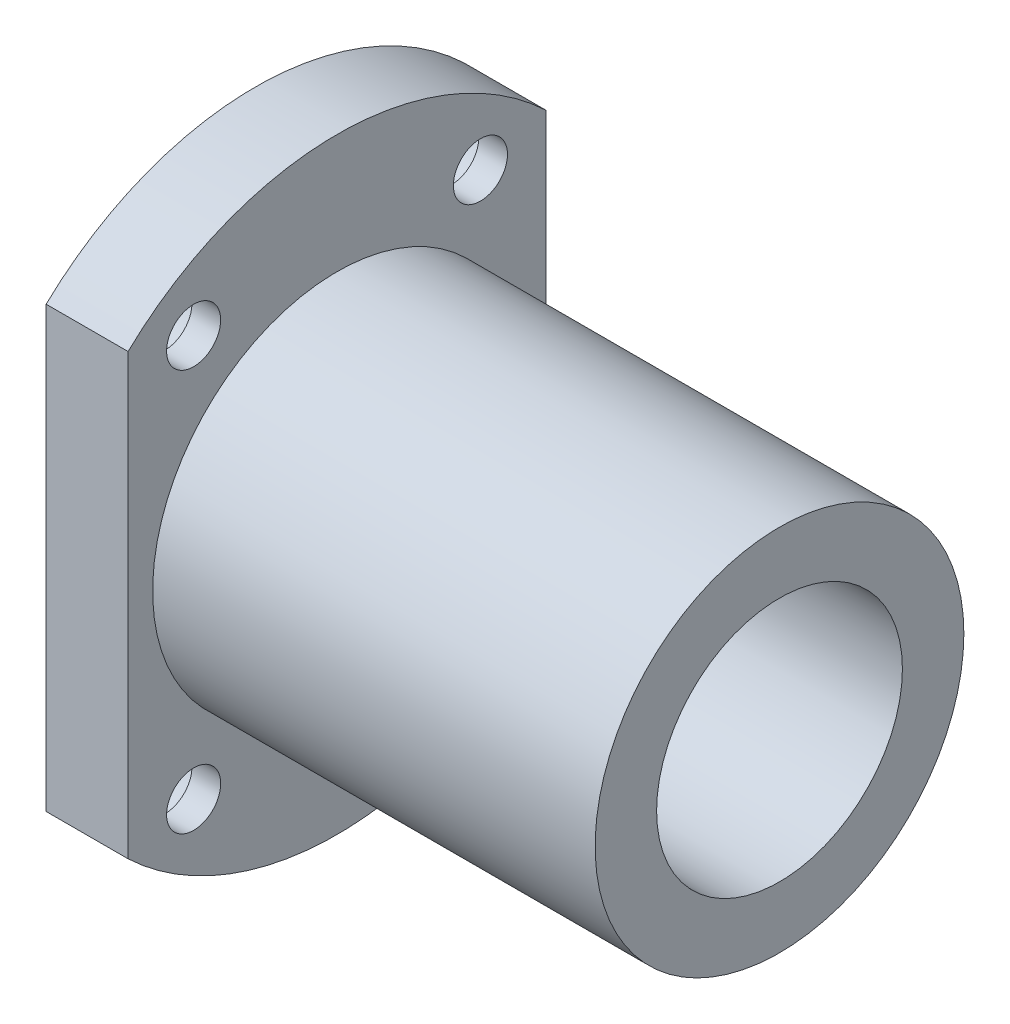
ISO-10303-21;
HEADER;
FILE_DESCRIPTION(('STEP AP214'),'2;1');
FILE_NAME('part.step','',(''),(''),'','','');
FILE_SCHEMA(('AUTOMOTIVE_DESIGN { 1 0 10303 214 1 1 1 1 }'));
ENDSEC;
DATA;
#1=APPLICATION_CONTEXT('core data for automotive mechanical design processes');
#2=APPLICATION_PROTOCOL_DEFINITION('international standard','automotive_design',2000,#1);
#3=PRODUCT_CONTEXT('',#1,'mechanical');
#4=PRODUCT('Part','Part','',(#3));
#5=PRODUCT_RELATED_PRODUCT_CATEGORY('part','',(#4));
#6=PRODUCT_DEFINITION_FORMATION('','',#4);
#7=PRODUCT_DEFINITION_CONTEXT('part definition',#1,'design');
#8=PRODUCT_DEFINITION('design','',#6,#7);
#9=PRODUCT_DEFINITION_SHAPE('','',#8);
#10=(LENGTH_UNIT() NAMED_UNIT(*) SI_UNIT(.MILLI.,.METRE.));
#11=(NAMED_UNIT(*) PLANE_ANGLE_UNIT() SI_UNIT($,.RADIAN.));
#12=(NAMED_UNIT(*) SI_UNIT($,.STERADIAN.) SOLID_ANGLE_UNIT());
#13=UNCERTAINTY_MEASURE_WITH_UNIT(LENGTH_MEASURE(1.E-05),#10,'distance_accuracy_value','');
#14=(GEOMETRIC_REPRESENTATION_CONTEXT(3) GLOBAL_UNCERTAINTY_ASSIGNED_CONTEXT((#13)) GLOBAL_UNIT_ASSIGNED_CONTEXT((#10,
#11,#12)) REPRESENTATION_CONTEXT('',''));
#15=CARTESIAN_POINT('',(0.,0.,0.));
#16=DIRECTION('',(0.,0.,1.));
#17=DIRECTION('',(1.,0.,0.));
#18=AXIS2_PLACEMENT_3D('',#15,#16,#17);
#19=CARTESIAN_POINT('',(10.,0.,0.));
#20=DIRECTION('',(-1.,0.,0.));
#21=DIRECTION('',(0.,0.,1.));
#22=AXIS2_PLACEMENT_3D('',#19,#20,#21);
#23=CYLINDRICAL_SURFACE('',#22,37.);
#24=CARTESIAN_POINT('',(10.,0.,0.));
#25=DIRECTION('',(1.,0.,0.));
#26=DIRECTION('',(0.,0.,-1.));
#27=AXIS2_PLACEMENT_3D('',#24,#25,#26);
#28=CIRCLE('',#27,37.);
#29=CARTESIAN_POINT('',(10.,-26.809513236909,25.5));
#30=VERTEX_POINT('',#29);
#31=CARTESIAN_POINT('',(10.,-26.809513236909,-25.5));
#32=VERTEX_POINT('',#31);
#33=EDGE_CURVE('E46',#30,#32,#28,.T.);
#34=ORIENTED_EDGE('',*,*,#33,.F.);
#35=DIRECTION('',(-1.,0.,0.));
#36=VECTOR('',#35,1.);
#37=CARTESIAN_POINT('',(64.,-26.809513236909,25.5));
#38=LINE('',#37,#36);
#39=CARTESIAN_POINT('',(0.,-26.809513236909,25.5));
#40=VERTEX_POINT('',#39);
#41=EDGE_CURVE('E81',#30,#40,#38,.T.);
#42=ORIENTED_EDGE('',*,*,#41,.T.);
#43=CARTESIAN_POINT('',(0.,0.,0.));
#44=DIRECTION('',(1.,0.,0.));
#45=DIRECTION('',(0.,0.,-1.));
#46=AXIS2_PLACEMENT_3D('',#43,#44,#45);
#47=CIRCLE('',#46,37.);
#48=CARTESIAN_POINT('',(0.,-26.809513236909,-25.5));
#49=VERTEX_POINT('',#48);
#50=EDGE_CURVE('E62',#40,#49,#47,.T.);
#51=ORIENTED_EDGE('',*,*,#50,.T.);
#52=DIRECTION('',(-1.,0.,0.));
#53=VECTOR('',#52,1.);
#54=CARTESIAN_POINT('',(64.,-26.809513236909,-25.5));
#55=LINE('',#54,#53);
#56=EDGE_CURVE('E142',#32,#49,#55,.T.);
#57=ORIENTED_EDGE('',*,*,#56,.F.);
#58=EDGE_LOOP('',(#34,#42,#51,#57));
#59=FACE_BOUND('',#58,.T.);
#60=ADVANCED_FACE('F37',(#59),#23,.T.);
#61=CARTESIAN_POINT('',(0.,26.809513236909,-25.5));
#62=VERTEX_POINT('',#61);
#63=CARTESIAN_POINT('',(0.,26.809513236909,25.5));
#64=VERTEX_POINT('',#63);
#65=EDGE_CURVE('E94',#62,#64,#47,.T.);
#66=ORIENTED_EDGE('',*,*,#65,.T.);
#67=DIRECTION('',(-1.,0.,0.));
#68=VECTOR('',#67,1.);
#69=CARTESIAN_POINT('',(64.,26.809513236909,25.5));
#70=LINE('',#69,#68);
#71=CARTESIAN_POINT('',(10.,26.809513236909,25.5));
#72=VERTEX_POINT('',#71);
#73=EDGE_CURVE('E54',#72,#64,#70,.T.);
#74=ORIENTED_EDGE('',*,*,#73,.F.);
#75=CARTESIAN_POINT('',(10.,26.809513236909,-25.5));
#76=VERTEX_POINT('',#75);
#77=EDGE_CURVE('E11',#76,#72,#28,.T.);
#78=ORIENTED_EDGE('',*,*,#77,.F.);
#79=DIRECTION('',(-1.,0.,0.));
#80=VECTOR('',#79,1.);
#81=CARTESIAN_POINT('',(64.,26.809513236909,-25.5));
#82=LINE('',#81,#80);
#83=EDGE_CURVE('E143',#76,#62,#82,.T.);
#84=ORIENTED_EDGE('',*,*,#83,.T.);
#85=EDGE_LOOP('',(#66,#74,#78,#84));
#86=FACE_BOUND('',#85,.T.);
#87=ADVANCED_FACE('F39',(#86),#23,.T.);
#88=CARTESIAN_POINT('',(10.,0.,0.));
#89=DIRECTION('',(1.,0.,0.));
#90=DIRECTION('',(0.,0.,-1.));
#91=AXIS2_PLACEMENT_3D('',#88,#89,#90);
#92=PLANE('',#91);
#93=CARTESIAN_POINT('',(10.,24.5,-17.5));
#94=DIRECTION('',(1.,0.,0.));
#95=DIRECTION('',(0.,0.,-1.));
#96=AXIS2_PLACEMENT_3D('',#93,#94,#95);
#97=CIRCLE('',#96,3.3);
#98=CARTESIAN_POINT('',(10.,24.5,-20.8));
#99=VERTEX_POINT('',#98);
#100=EDGE_CURVE('E41',#99,#99,#97,.T.);
#101=ORIENTED_EDGE('',*,*,#100,.F.);
#102=EDGE_LOOP('',(#101));
#103=FACE_BOUND('',#102,.T.);
#104=CARTESIAN_POINT('',(10.,24.5,17.5));
#105=DIRECTION('',(1.,0.,0.));
#106=DIRECTION('',(0.,0.,-1.));
#107=AXIS2_PLACEMENT_3D('',#104,#105,#106);
#108=CIRCLE('',#107,3.3);
#109=CARTESIAN_POINT('',(10.,24.5,14.2));
#110=VERTEX_POINT('',#109);
#111=EDGE_CURVE('E109',#110,#110,#108,.T.);
#112=ORIENTED_EDGE('',*,*,#111,.F.);
#113=EDGE_LOOP('',(#112));
#114=FACE_BOUND('',#113,.T.);
#115=CARTESIAN_POINT('',(10.,-24.5,17.5));
#116=DIRECTION('',(1.,0.,0.));
#117=DIRECTION('',(0.,0.,-1.));
#118=AXIS2_PLACEMENT_3D('',#115,#116,#117);
#119=CIRCLE('',#118,3.3);
#120=CARTESIAN_POINT('',(10.,-24.5,14.2));
#121=VERTEX_POINT('',#120);
#122=EDGE_CURVE('E105',#121,#121,#119,.T.);
#123=ORIENTED_EDGE('',*,*,#122,.F.);
#124=EDGE_LOOP('',(#123));
#125=FACE_BOUND('',#124,.T.);
#126=CARTESIAN_POINT('',(10.,-24.5,-17.5));
#127=DIRECTION('',(1.,0.,0.));
#128=DIRECTION('',(0.,0.,-1.));
#129=AXIS2_PLACEMENT_3D('',#126,#127,#128);
#130=CIRCLE('',#129,3.3);
#131=CARTESIAN_POINT('',(10.,-24.5,-20.8));
#132=VERTEX_POINT('',#131);
#133=EDGE_CURVE('E86',#132,#132,#130,.T.);
#134=ORIENTED_EDGE('',*,*,#133,.F.);
#135=EDGE_LOOP('',(#134));
#136=FACE_BOUND('',#135,.T.);
#137=DIRECTION('',(0.,1.,0.));
#138=VECTOR('',#137,1.);
#139=CARTESIAN_POINT('',(10.,0.,25.5));
#140=LINE('',#139,#138);
#141=EDGE_CURVE('E89',#30,#72,#140,.T.);
#142=ORIENTED_EDGE('',*,*,#141,.F.);
#143=ORIENTED_EDGE('',*,*,#33,.T.);
#144=DIRECTION('',(0.,-1.,0.));
#145=VECTOR('',#144,1.);
#146=CARTESIAN_POINT('',(10.,0.,-25.5));
#147=LINE('',#146,#145);
#148=EDGE_CURVE('E146',#76,#32,#147,.T.);
#149=ORIENTED_EDGE('',*,*,#148,.F.);
#150=ORIENTED_EDGE('',*,*,#77,.T.);
#151=EDGE_LOOP('',(#142,#143,#149,#150));
#152=FACE_BOUND('',#151,.T.);
#153=CARTESIAN_POINT('',(10.,0.,0.));
#154=DIRECTION('',(1.,0.,0.));
#155=DIRECTION('',(0.,0.,-1.));
#156=AXIS2_PLACEMENT_3D('',#153,#154,#155);
#157=CIRCLE('',#156,22.5);
#158=CARTESIAN_POINT('',(10.,0.,-22.5));
#159=VERTEX_POINT('',#158);
#160=EDGE_CURVE('E98',#159,#159,#157,.T.);
#161=ORIENTED_EDGE('',*,*,#160,.F.);
#162=EDGE_LOOP('',(#161));
#163=FACE_BOUND('',#162,.T.);
#164=ADVANCED_FACE('F160',(#103,#114,#125,#136,#152,#163),#92,.T.);
#165=CARTESIAN_POINT('',(0.,0.,0.));
#166=DIRECTION('',(1.,0.,0.));
#167=DIRECTION('',(0.,0.,-1.));
#168=AXIS2_PLACEMENT_3D('',#165,#166,#167);
#169=PLANE('',#168);
#170=CARTESIAN_POINT('',(0.,24.5,-17.5));
#171=DIRECTION('',(-1.,0.,0.));
#172=DIRECTION('',(0.,0.,1.));
#173=AXIS2_PLACEMENT_3D('',#170,#171,#172);
#174=CIRCLE('',#173,5.49999999999999);
#175=CARTESIAN_POINT('',(0.,24.5,-12.));
#176=VERTEX_POINT('',#175);
#177=EDGE_CURVE('E373',#176,#176,#174,.T.);
#178=ORIENTED_EDGE('',*,*,#177,.F.);
#179=EDGE_LOOP('',(#178));
#180=FACE_BOUND('',#179,.T.);
#181=CARTESIAN_POINT('',(0.,24.5,17.5));
#182=DIRECTION('',(-1.,0.,0.));
#183=DIRECTION('',(0.,0.,1.));
#184=AXIS2_PLACEMENT_3D('',#181,#182,#183);
#185=CIRCLE('',#184,5.49999999999999);
#186=CARTESIAN_POINT('',(0.,24.5,23.));
#187=VERTEX_POINT('',#186);
#188=EDGE_CURVE('E124',#187,#187,#185,.T.);
#189=ORIENTED_EDGE('',*,*,#188,.F.);
#190=EDGE_LOOP('',(#189));
#191=FACE_BOUND('',#190,.T.);
#192=CARTESIAN_POINT('',(0.,-24.5,17.5));
#193=DIRECTION('',(-1.,0.,0.));
#194=DIRECTION('',(0.,0.,1.));
#195=AXIS2_PLACEMENT_3D('',#192,#193,#194);
#196=CIRCLE('',#195,5.49999999999999);
#197=CARTESIAN_POINT('',(0.,-24.5,23.));
#198=VERTEX_POINT('',#197);
#199=EDGE_CURVE('E111',#198,#198,#196,.T.);
#200=ORIENTED_EDGE('',*,*,#199,.F.);
#201=EDGE_LOOP('',(#200));
#202=FACE_BOUND('',#201,.T.);
#203=CARTESIAN_POINT('',(0.,-24.5,-17.5));
#204=DIRECTION('',(-1.,0.,0.));
#205=DIRECTION('',(0.,0.,1.));
#206=AXIS2_PLACEMENT_3D('',#203,#204,#205);
#207=CIRCLE('',#206,5.49999999999999);
#208=CARTESIAN_POINT('',(0.,-24.5,-12.));
#209=VERTEX_POINT('',#208);
#210=EDGE_CURVE('E107',#209,#209,#207,.T.);
#211=ORIENTED_EDGE('',*,*,#210,.F.);
#212=EDGE_LOOP('',(#211));
#213=FACE_BOUND('',#212,.T.);
#214=CARTESIAN_POINT('',(0.,0.,0.));
#215=DIRECTION('',(-1.,0.,0.));
#216=DIRECTION('',(0.,0.,1.));
#217=AXIS2_PLACEMENT_3D('',#214,#215,#216);
#218=CIRCLE('',#217,15.);
#219=CARTESIAN_POINT('',(0.,0.,15.));
#220=VERTEX_POINT('',#219);
#221=EDGE_CURVE('E150',#220,#220,#218,.T.);
#222=ORIENTED_EDGE('',*,*,#221,.F.);
#223=EDGE_LOOP('',(#222));
#224=FACE_BOUND('',#223,.T.);
#225=ORIENTED_EDGE('',*,*,#50,.F.);
#226=DIRECTION('',(0.,-1.,0.));
#227=VECTOR('',#226,1.);
#228=CARTESIAN_POINT('',(0.,26.809513236909,25.5));
#229=LINE('',#228,#227);
#230=EDGE_CURVE('E79',#64,#40,#229,.T.);
#231=ORIENTED_EDGE('',*,*,#230,.F.);
#232=ORIENTED_EDGE('',*,*,#65,.F.);
#233=DIRECTION('',(0.,1.,0.));
#234=VECTOR('',#233,1.);
#235=CARTESIAN_POINT('',(0.,26.809513236909,-25.5));
#236=LINE('',#235,#234);
#237=EDGE_CURVE('E93',#49,#62,#236,.T.);
#238=ORIENTED_EDGE('',*,*,#237,.F.);
#239=EDGE_LOOP('',(#225,#231,#232,#238));
#240=FACE_BOUND('',#239,.T.);
#241=ADVANCED_FACE('F92',(#180,#191,#202,#213,#224,#240),#169,.F.);
#242=CARTESIAN_POINT('',(64.,0.,0.));
#243=DIRECTION('',(-1.,0.,0.));
#244=DIRECTION('',(0.,0.,1.));
#245=AXIS2_PLACEMENT_3D('',#242,#243,#244);
#246=CYLINDRICAL_SURFACE('',#245,22.5);
#247=CARTESIAN_POINT('',(64.,0.,0.));
#248=DIRECTION('',(1.,0.,0.));
#249=DIRECTION('',(0.,0.,-1.));
#250=AXIS2_PLACEMENT_3D('',#247,#248,#249);
#251=CIRCLE('',#250,22.5);
#252=CARTESIAN_POINT('',(64.,0.,-22.5));
#253=VERTEX_POINT('',#252);
#254=EDGE_CURVE('E95',#253,#253,#251,.T.);
#255=ORIENTED_EDGE('',*,*,#254,.F.);
#256=EDGE_LOOP('',(#255));
#257=FACE_BOUND('',#256,.T.);
#258=ORIENTED_EDGE('',*,*,#160,.T.);
#259=EDGE_LOOP('',(#258));
#260=FACE_BOUND('',#259,.T.);
#261=ADVANCED_FACE('F158',(#257,#260),#246,.T.);
#262=CARTESIAN_POINT('',(64.,0.,0.));
#263=DIRECTION('',(1.,0.,0.));
#264=DIRECTION('',(0.,0.,-1.));
#265=AXIS2_PLACEMENT_3D('',#262,#263,#264);
#266=PLANE('',#265);
#267=CARTESIAN_POINT('',(64.,0.,0.));
#268=DIRECTION('',(-1.,0.,0.));
#269=DIRECTION('',(0.,0.,1.));
#270=AXIS2_PLACEMENT_3D('',#267,#268,#269);
#271=CIRCLE('',#270,15.);
#272=CARTESIAN_POINT('',(64.,0.,15.));
#273=VERTEX_POINT('',#272);
#274=EDGE_CURVE('E151',#273,#273,#271,.T.);
#275=ORIENTED_EDGE('',*,*,#274,.T.);
#276=EDGE_LOOP('',(#275));
#277=FACE_BOUND('',#276,.T.);
#278=ORIENTED_EDGE('',*,*,#254,.T.);
#279=EDGE_LOOP('',(#278));
#280=FACE_BOUND('',#279,.T.);
#281=ADVANCED_FACE('F340',(#277,#280),#266,.T.);
#282=CARTESIAN_POINT('',(64.,0.,0.));
#283=DIRECTION('',(-1.,0.,0.));
#284=DIRECTION('',(0.,0.,1.));
#285=AXIS2_PLACEMENT_3D('',#282,#283,#284);
#286=CYLINDRICAL_SURFACE('',#285,15.);
#287=ORIENTED_EDGE('',*,*,#274,.F.);
#288=EDGE_LOOP('',(#287));
#289=FACE_BOUND('',#288,.T.);
#290=ORIENTED_EDGE('',*,*,#221,.T.);
#291=EDGE_LOOP('',(#290));
#292=FACE_BOUND('',#291,.T.);
#293=ADVANCED_FACE('F192',(#289,#292),#286,.F.);
#294=CARTESIAN_POINT('',(64.,26.809513236909,-25.5));
#295=DIRECTION('',(0.,0.,1.));
#296=DIRECTION('',(0.,-1.,0.));
#297=AXIS2_PLACEMENT_3D('',#294,#295,#296);
#298=PLANE('',#297);
#299=ORIENTED_EDGE('',*,*,#148,.T.);
#300=ORIENTED_EDGE('',*,*,#56,.T.);
#301=ORIENTED_EDGE('',*,*,#237,.T.);
#302=ORIENTED_EDGE('',*,*,#83,.F.);
#303=EDGE_LOOP('',(#299,#300,#301,#302));
#304=FACE_BOUND('',#303,.T.);
#305=ADVANCED_FACE('F187',(#304),#298,.F.);
#306=CARTESIAN_POINT('',(64.,26.809513236909,25.5));
#307=DIRECTION('',(0.,0.,-1.));
#308=DIRECTION('',(0.,1.,0.));
#309=AXIS2_PLACEMENT_3D('',#306,#307,#308);
#310=PLANE('',#309);
#311=ORIENTED_EDGE('',*,*,#141,.T.);
#312=ORIENTED_EDGE('',*,*,#73,.T.);
#313=ORIENTED_EDGE('',*,*,#230,.T.);
#314=ORIENTED_EDGE('',*,*,#41,.F.);
#315=EDGE_LOOP('',(#311,#312,#313,#314));
#316=FACE_BOUND('',#315,.T.);
#317=ADVANCED_FACE('F80',(#316),#310,.F.);
#318=CARTESIAN_POINT('',(0.,-24.5,-17.5));
#319=DIRECTION('',(-1.,0.,0.));
#320=DIRECTION('',(0.,0.,1.));
#321=AXIS2_PLACEMENT_3D('',#318,#319,#320);
#322=CYLINDRICAL_SURFACE('',#321,3.3);
#323=ORIENTED_EDGE('',*,*,#133,.T.);
#324=EDGE_LOOP('',(#323));
#325=FACE_BOUND('',#324,.T.);
#326=CARTESIAN_POINT('',(6.5,-24.5,-17.5));
#327=DIRECTION('',(-1.,0.,0.));
#328=DIRECTION('',(0.,0.,1.));
#329=AXIS2_PLACEMENT_3D('',#326,#327,#328);
#330=CIRCLE('',#329,3.30000000000001);
#331=CARTESIAN_POINT('',(6.5,-24.5,-14.2));
#332=VERTEX_POINT('',#331);
#333=EDGE_CURVE('E104',#332,#332,#330,.T.);
#334=ORIENTED_EDGE('',*,*,#333,.T.);
#335=EDGE_LOOP('',(#334));
#336=FACE_BOUND('',#335,.T.);
#337=ADVANCED_FACE('F202',(#325,#336),#322,.F.);
#338=CARTESIAN_POINT('',(6.5,-21.2,-17.5));
#339=DIRECTION('',(1.,0.,0.));
#340=DIRECTION('',(0.,0.,-1.));
#341=AXIS2_PLACEMENT_3D('',#338,#339,#340);
#342=PLANE('',#341);
#343=ORIENTED_EDGE('',*,*,#333,.F.);
#344=EDGE_LOOP('',(#343));
#345=FACE_BOUND('',#344,.T.);
#346=CARTESIAN_POINT('',(6.5,-24.5,-17.5));
#347=DIRECTION('',(-1.,0.,0.));
#348=DIRECTION('',(0.,0.,1.));
#349=AXIS2_PLACEMENT_3D('',#346,#347,#348);
#350=CIRCLE('',#349,5.49999999999999);
#351=CARTESIAN_POINT('',(6.5,-24.5,-12.));
#352=VERTEX_POINT('',#351);
#353=EDGE_CURVE('E134',#352,#352,#350,.T.);
#354=ORIENTED_EDGE('',*,*,#353,.T.);
#355=EDGE_LOOP('',(#354));
#356=FACE_BOUND('',#355,.T.);
#357=ADVANCED_FACE('F223',(#345,#356),#342,.F.);
#358=CARTESIAN_POINT('',(0.,-24.5,-17.5));
#359=DIRECTION('',(-1.,0.,0.));
#360=DIRECTION('',(0.,0.,1.));
#361=AXIS2_PLACEMENT_3D('',#358,#359,#360);
#362=CYLINDRICAL_SURFACE('',#361,5.49999999999999);
#363=ORIENTED_EDGE('',*,*,#353,.F.);
#364=EDGE_LOOP('',(#363));
#365=FACE_BOUND('',#364,.T.);
#366=ORIENTED_EDGE('',*,*,#210,.T.);
#367=EDGE_LOOP('',(#366));
#368=FACE_BOUND('',#367,.T.);
#369=ADVANCED_FACE('F233',(#365,#368),#362,.F.);
#370=CARTESIAN_POINT('',(0.,-24.5,17.5));
#371=DIRECTION('',(-1.,0.,0.));
#372=DIRECTION('',(0.,0.,1.));
#373=AXIS2_PLACEMENT_3D('',#370,#371,#372);
#374=CYLINDRICAL_SURFACE('',#373,3.3);
#375=ORIENTED_EDGE('',*,*,#122,.T.);
#376=EDGE_LOOP('',(#375));
#377=FACE_BOUND('',#376,.T.);
#378=CARTESIAN_POINT('',(6.5,-24.5,17.5));
#379=DIRECTION('',(-1.,0.,0.));
#380=DIRECTION('',(0.,0.,1.));
#381=AXIS2_PLACEMENT_3D('',#378,#379,#380);
#382=CIRCLE('',#381,3.30000000000001);
#383=CARTESIAN_POINT('',(6.5,-24.5,20.8));
#384=VERTEX_POINT('',#383);
#385=EDGE_CURVE('E108',#384,#384,#382,.T.);
#386=ORIENTED_EDGE('',*,*,#385,.T.);
#387=EDGE_LOOP('',(#386));
#388=FACE_BOUND('',#387,.T.);
#389=ADVANCED_FACE('F243',(#377,#388),#374,.F.);
#390=CARTESIAN_POINT('',(6.5,-21.2,17.5));
#391=DIRECTION('',(1.,0.,0.));
#392=DIRECTION('',(0.,0.,-1.));
#393=AXIS2_PLACEMENT_3D('',#390,#391,#392);
#394=PLANE('',#393);
#395=ORIENTED_EDGE('',*,*,#385,.F.);
#396=EDGE_LOOP('',(#395));
#397=FACE_BOUND('',#396,.T.);
#398=CARTESIAN_POINT('',(6.5,-24.5,17.5));
#399=DIRECTION('',(-1.,0.,0.));
#400=DIRECTION('',(0.,0.,1.));
#401=AXIS2_PLACEMENT_3D('',#398,#399,#400);
#402=CIRCLE('',#401,5.49999999999999);
#403=CARTESIAN_POINT('',(6.5,-24.5,23.));
#404=VERTEX_POINT('',#403);
#405=EDGE_CURVE('E116',#404,#404,#402,.T.);
#406=ORIENTED_EDGE('',*,*,#405,.T.);
#407=EDGE_LOOP('',(#406));
#408=FACE_BOUND('',#407,.T.);
#409=ADVANCED_FACE('F253',(#397,#408),#394,.F.);
#410=CARTESIAN_POINT('',(0.,-24.5,17.5));
#411=DIRECTION('',(-1.,0.,0.));
#412=DIRECTION('',(0.,0.,1.));
#413=AXIS2_PLACEMENT_3D('',#410,#411,#412);
#414=CYLINDRICAL_SURFACE('',#413,5.49999999999999);
#415=ORIENTED_EDGE('',*,*,#405,.F.);
#416=EDGE_LOOP('',(#415));
#417=FACE_BOUND('',#416,.T.);
#418=ORIENTED_EDGE('',*,*,#199,.T.);
#419=EDGE_LOOP('',(#418));
#420=FACE_BOUND('',#419,.T.);
#421=ADVANCED_FACE('F263',(#417,#420),#414,.F.);
#422=CARTESIAN_POINT('',(0.,24.5,17.5));
#423=DIRECTION('',(-1.,0.,0.));
#424=DIRECTION('',(0.,0.,1.));
#425=AXIS2_PLACEMENT_3D('',#422,#423,#424);
#426=CYLINDRICAL_SURFACE('',#425,3.3);
#427=ORIENTED_EDGE('',*,*,#111,.T.);
#428=EDGE_LOOP('',(#427));
#429=FACE_BOUND('',#428,.T.);
#430=CARTESIAN_POINT('',(6.5,24.5,17.5));
#431=DIRECTION('',(-1.,0.,0.));
#432=DIRECTION('',(0.,0.,1.));
#433=AXIS2_PLACEMENT_3D('',#430,#431,#432);
#434=CIRCLE('',#433,3.30000000000001);
#435=CARTESIAN_POINT('',(6.5,24.5,20.8));
#436=VERTEX_POINT('',#435);
#437=EDGE_CURVE('E112',#436,#436,#434,.T.);
#438=ORIENTED_EDGE('',*,*,#437,.T.);
#439=EDGE_LOOP('',(#438));
#440=FACE_BOUND('',#439,.T.);
#441=ADVANCED_FACE('F273',(#429,#440),#426,.F.);
#442=CARTESIAN_POINT('',(6.5,27.8,17.5));
#443=DIRECTION('',(1.,0.,0.));
#444=DIRECTION('',(0.,0.,-1.));
#445=AXIS2_PLACEMENT_3D('',#442,#443,#444);
#446=PLANE('',#445);
#447=ORIENTED_EDGE('',*,*,#437,.F.);
#448=EDGE_LOOP('',(#447));
#449=FACE_BOUND('',#448,.T.);
#450=CARTESIAN_POINT('',(6.5,24.5,17.5));
#451=DIRECTION('',(-1.,0.,0.));
#452=DIRECTION('',(0.,0.,1.));
#453=AXIS2_PLACEMENT_3D('',#450,#451,#452);
#454=CIRCLE('',#453,5.49999999999999);
#455=CARTESIAN_POINT('',(6.5,24.5,23.));
#456=VERTEX_POINT('',#455);
#457=EDGE_CURVE('E119',#456,#456,#454,.T.);
#458=ORIENTED_EDGE('',*,*,#457,.T.);
#459=EDGE_LOOP('',(#458));
#460=FACE_BOUND('',#459,.T.);
#461=ADVANCED_FACE('F283',(#449,#460),#446,.F.);
#462=CARTESIAN_POINT('',(0.,24.5,17.5));
#463=DIRECTION('',(-1.,0.,0.));
#464=DIRECTION('',(0.,0.,1.));
#465=AXIS2_PLACEMENT_3D('',#462,#463,#464);
#466=CYLINDRICAL_SURFACE('',#465,5.49999999999999);
#467=ORIENTED_EDGE('',*,*,#457,.F.);
#468=EDGE_LOOP('',(#467));
#469=FACE_BOUND('',#468,.T.);
#470=ORIENTED_EDGE('',*,*,#188,.T.);
#471=EDGE_LOOP('',(#470));
#472=FACE_BOUND('',#471,.T.);
#473=ADVANCED_FACE('F292',(#469,#472),#466,.F.);
#474=CARTESIAN_POINT('',(0.,24.5,-17.5));
#475=DIRECTION('',(-1.,0.,0.));
#476=DIRECTION('',(0.,0.,1.));
#477=AXIS2_PLACEMENT_3D('',#474,#475,#476);
#478=CYLINDRICAL_SURFACE('',#477,3.3);
#479=ORIENTED_EDGE('',*,*,#100,.T.);
#480=EDGE_LOOP('',(#479));
#481=FACE_BOUND('',#480,.T.);
#482=CARTESIAN_POINT('',(6.5,24.5,-17.5));
#483=DIRECTION('',(-1.,0.,0.));
#484=DIRECTION('',(0.,0.,1.));
#485=AXIS2_PLACEMENT_3D('',#482,#483,#484);
#486=CIRCLE('',#485,3.30000000000001);
#487=CARTESIAN_POINT('',(6.5,24.5,-14.2));
#488=VERTEX_POINT('',#487);
#489=EDGE_CURVE('E375',#488,#488,#486,.T.);
#490=ORIENTED_EDGE('',*,*,#489,.T.);
#491=EDGE_LOOP('',(#490));
#492=FACE_BOUND('',#491,.T.);
#493=ADVANCED_FACE('F302',(#481,#492),#478,.F.);
#494=CARTESIAN_POINT('',(6.5,27.8,-17.5));
#495=DIRECTION('',(1.,0.,0.));
#496=DIRECTION('',(0.,0.,-1.));
#497=AXIS2_PLACEMENT_3D('',#494,#495,#496);
#498=PLANE('',#497);
#499=ORIENTED_EDGE('',*,*,#489,.F.);
#500=EDGE_LOOP('',(#499));
#501=FACE_BOUND('',#500,.T.);
#502=CARTESIAN_POINT('',(6.5,24.5,-17.5));
#503=DIRECTION('',(-1.,0.,0.));
#504=DIRECTION('',(0.,0.,1.));
#505=AXIS2_PLACEMENT_3D('',#502,#503,#504);
#506=CIRCLE('',#505,5.49999999999999);
#507=CARTESIAN_POINT('',(6.5,24.5,-12.));
#508=VERTEX_POINT('',#507);
#509=EDGE_CURVE('E370',#508,#508,#506,.T.);
#510=ORIENTED_EDGE('',*,*,#509,.T.);
#511=EDGE_LOOP('',(#510));
#512=FACE_BOUND('',#511,.T.);
#513=ADVANCED_FACE('F312',(#501,#512),#498,.F.);
#514=CARTESIAN_POINT('',(0.,24.5,-17.5));
#515=DIRECTION('',(-1.,0.,0.));
#516=DIRECTION('',(0.,0.,1.));
#517=AXIS2_PLACEMENT_3D('',#514,#515,#516);
#518=CYLINDRICAL_SURFACE('',#517,5.49999999999999);
#519=ORIENTED_EDGE('',*,*,#509,.F.);
#520=EDGE_LOOP('',(#519));
#521=FACE_BOUND('',#520,.T.);
#522=ORIENTED_EDGE('',*,*,#177,.T.);
#523=EDGE_LOOP('',(#522));
#524=FACE_BOUND('',#523,.T.);
#525=ADVANCED_FACE('F322',(#521,#524),#518,.F.);
#526=CLOSED_SHELL('',(#60,#87,#164,#241,#261,#281,#293,#305,#317,#337,#357,#369,#389,#409,#421,
#441,#461,#473,#493,#513,#525));
#527=MANIFOLD_SOLID_BREP('B2',#526);
#528=ADVANCED_BREP_SHAPE_REPRESENTATION('',(#18,#527),#14);
#529=SHAPE_DEFINITION_REPRESENTATION(#9,#528);
ENDSEC;
END-ISO-10303-21;
